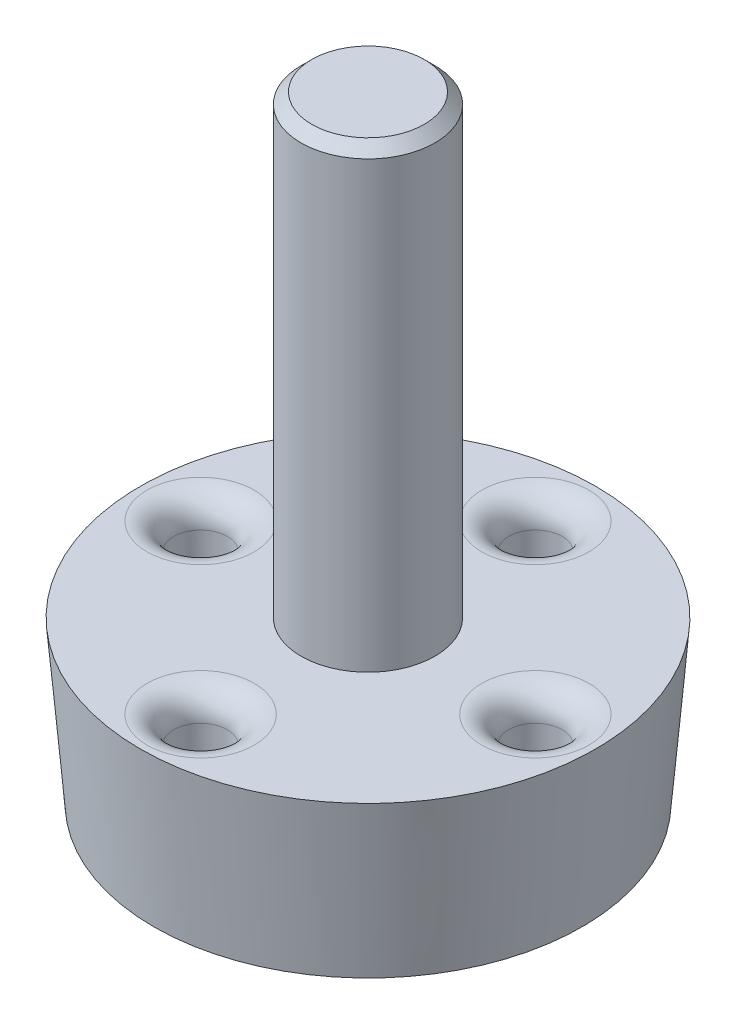
ISO-10303-21;
HEADER;
FILE_DESCRIPTION(('STEP AP214'),'2;1');
FILE_NAME('part.step','',(''),(''),'','','');
FILE_SCHEMA(('AUTOMOTIVE_DESIGN { 1 0 10303 214 1 1 1 1 }'));
ENDSEC;
DATA;
#1=APPLICATION_CONTEXT('core data for automotive mechanical design processes');
#2=APPLICATION_PROTOCOL_DEFINITION('international standard','automotive_design',2000,#1);
#3=PRODUCT_CONTEXT('',#1,'mechanical');
#4=PRODUCT('Part','Part','',(#3));
#5=PRODUCT_RELATED_PRODUCT_CATEGORY('part','',(#4));
#6=PRODUCT_DEFINITION_FORMATION('','',#4);
#7=PRODUCT_DEFINITION_CONTEXT('part definition',#1,'design');
#8=PRODUCT_DEFINITION('design','',#6,#7);
#9=PRODUCT_DEFINITION_SHAPE('','',#8);
#10=(LENGTH_UNIT() NAMED_UNIT(*) SI_UNIT(.MILLI.,.METRE.));
#11=(NAMED_UNIT(*) PLANE_ANGLE_UNIT() SI_UNIT($,.RADIAN.));
#12=(NAMED_UNIT(*) SI_UNIT($,.STERADIAN.) SOLID_ANGLE_UNIT());
#13=UNCERTAINTY_MEASURE_WITH_UNIT(LENGTH_MEASURE(1.E-05),#10,'distance_accuracy_value','');
#14=(GEOMETRIC_REPRESENTATION_CONTEXT(3) GLOBAL_UNCERTAINTY_ASSIGNED_CONTEXT((#13)) GLOBAL_UNIT_ASSIGNED_CONTEXT((#10,
#11,#12)) REPRESENTATION_CONTEXT('',''));
#15=CARTESIAN_POINT('',(0.,0.,0.));
#16=DIRECTION('',(0.,0.,1.));
#17=DIRECTION('',(1.,0.,0.));
#18=AXIS2_PLACEMENT_3D('',#15,#16,#17);
#19=CARTESIAN_POINT('',(0.,0.,0.));
#20=DIRECTION('',(0.,1.,0.));
#21=DIRECTION('',(0.,0.,1.));
#22=AXIS2_PLACEMENT_3D('',#19,#20,#21);
#23=PLANE('',#22);
#24=CARTESIAN_POINT('',(0.,0.,6.25));
#25=DIRECTION('',(0.,-1.,0.));
#26=DIRECTION('',(0.,0.,-1.));
#27=AXIS2_PLACEMENT_3D('',#24,#25,#26);
#28=CIRCLE('',#27,1.);
#29=CARTESIAN_POINT('',(0.,0.,5.25));
#30=VERTEX_POINT('',#29);
#31=EDGE_CURVE('E239',#30,#30,#28,.T.);
#32=ORIENTED_EDGE('',*,*,#31,.F.);
#33=EDGE_LOOP('',(#32));
#34=FACE_BOUND('',#33,.T.);
#35=CARTESIAN_POINT('',(6.25,0.,0.));
#36=DIRECTION('',(0.,-1.,0.));
#37=DIRECTION('',(0.,0.,-1.));
#38=AXIS2_PLACEMENT_3D('',#35,#36,#37);
#39=CIRCLE('',#38,1.);
#40=CARTESIAN_POINT('',(6.25,0.,-0.999999999999999));
#41=VERTEX_POINT('',#40);
#42=EDGE_CURVE('E244',#41,#41,#39,.T.);
#43=ORIENTED_EDGE('',*,*,#42,.F.);
#44=EDGE_LOOP('',(#43));
#45=FACE_BOUND('',#44,.T.);
#46=CARTESIAN_POINT('',(0.,0.,-6.25));
#47=DIRECTION('',(0.,-1.,0.));
#48=DIRECTION('',(0.,0.,-1.));
#49=AXIS2_PLACEMENT_3D('',#46,#47,#48);
#50=CIRCLE('',#49,1.);
#51=CARTESIAN_POINT('',(0.,0.,-7.25));
#52=VERTEX_POINT('',#51);
#53=EDGE_CURVE('E236',#52,#52,#50,.T.);
#54=ORIENTED_EDGE('',*,*,#53,.F.);
#55=EDGE_LOOP('',(#54));
#56=FACE_BOUND('',#55,.T.);
#57=CARTESIAN_POINT('',(-6.25,0.,0.));
#58=DIRECTION('',(0.,-1.,0.));
#59=DIRECTION('',(0.,0.,-1.));
#60=AXIS2_PLACEMENT_3D('',#57,#58,#59);
#61=CIRCLE('',#60,1.);
#62=CARTESIAN_POINT('',(-6.25,0.,-0.999999999999999));
#63=VERTEX_POINT('',#62);
#64=EDGE_CURVE('E232',#63,#63,#61,.T.);
#65=ORIENTED_EDGE('',*,*,#64,.F.);
#66=EDGE_LOOP('',(#65));
#67=FACE_BOUND('',#66,.T.);
#68=CARTESIAN_POINT('',(0.,0.,0.));
#69=DIRECTION('',(0.,-1.,0.));
#70=DIRECTION('',(0.,0.,-1.));
#71=AXIS2_PLACEMENT_3D('',#68,#69,#70);
#72=CIRCLE('',#71,4.5);
#73=CARTESIAN_POINT('',(0.,0.,-4.5));
#74=VERTEX_POINT('',#73);
#75=EDGE_CURVE('E243',#74,#74,#72,.T.);
#76=ORIENTED_EDGE('',*,*,#75,.F.);
#77=EDGE_LOOP('',(#76));
#78=FACE_BOUND('',#77,.T.);
#79=CARTESIAN_POINT('',(0.,0.,0.));
#80=DIRECTION('',(0.,1.,0.));
#81=DIRECTION('',(0.,0.,1.));
#82=AXIS2_PLACEMENT_3D('',#79,#80,#81);
#83=CIRCLE('',#82,8.);
#84=CARTESIAN_POINT('',(0.,0.,8.));
#85=VERTEX_POINT('',#84);
#86=EDGE_CURVE('E108',#85,#85,#83,.T.);
#87=ORIENTED_EDGE('',*,*,#86,.F.);
#88=EDGE_LOOP('',(#87));
#89=FACE_BOUND('',#88,.T.);
#90=ADVANCED_FACE('F53',(#34,#45,#56,#67,#78,#89),#23,.F.);
#91=CARTESIAN_POINT('',(0.,6.,0.));
#92=DIRECTION('',(0.,1.,0.));
#93=DIRECTION('',(0.,0.,1.));
#94=AXIS2_PLACEMENT_3D('',#91,#92,#93);
#95=PLANE('',#94);
#96=CARTESIAN_POINT('',(-6.25,6.,0.));
#97=DIRECTION('',(0.,1.,0.));
#98=DIRECTION('',(0.,0.,1.));
#99=AXIS2_PLACEMENT_3D('',#96,#97,#98);
#100=CIRCLE('',#99,2.);
#101=CARTESIAN_POINT('',(-6.25,6.,2.));
#102=VERTEX_POINT('',#101);
#103=EDGE_CURVE('E77',#102,#102,#100,.F.);
#104=ORIENTED_EDGE('',*,*,#103,.T.);
#105=EDGE_LOOP('',(#104));
#106=FACE_BOUND('',#105,.T.);
#107=CARTESIAN_POINT('',(0.,6.,6.25));
#108=DIRECTION('',(0.,1.,0.));
#109=DIRECTION('',(0.,0.,1.));
#110=AXIS2_PLACEMENT_3D('',#107,#108,#109);
#111=CIRCLE('',#110,2.);
#112=CARTESIAN_POINT('',(0.,6.,8.25));
#113=VERTEX_POINT('',#112);
#114=EDGE_CURVE('E81',#113,#113,#111,.F.);
#115=ORIENTED_EDGE('',*,*,#114,.T.);
#116=EDGE_LOOP('',(#115));
#117=FACE_BOUND('',#116,.T.);
#118=CARTESIAN_POINT('',(6.25,6.,0.));
#119=DIRECTION('',(0.,1.,0.));
#120=DIRECTION('',(0.,0.,1.));
#121=AXIS2_PLACEMENT_3D('',#118,#119,#120);
#122=CIRCLE('',#121,2.);
#123=CARTESIAN_POINT('',(6.25,6.,2.));
#124=VERTEX_POINT('',#123);
#125=EDGE_CURVE('E85',#124,#124,#122,.F.);
#126=ORIENTED_EDGE('',*,*,#125,.T.);
#127=EDGE_LOOP('',(#126));
#128=FACE_BOUND('',#127,.T.);
#129=CARTESIAN_POINT('',(0.,6.,-6.25));
#130=DIRECTION('',(0.,1.,0.));
#131=DIRECTION('',(0.,0.,1.));
#132=AXIS2_PLACEMENT_3D('',#129,#130,#131);
#133=CIRCLE('',#132,2.);
#134=CARTESIAN_POINT('',(0.,6.,-4.25));
#135=VERTEX_POINT('',#134);
#136=EDGE_CURVE('E89',#135,#135,#133,.F.);
#137=ORIENTED_EDGE('',*,*,#136,.T.);
#138=EDGE_LOOP('',(#137));
#139=FACE_BOUND('',#138,.T.);
#140=CARTESIAN_POINT('',(0.,6.,0.));
#141=DIRECTION('',(0.,1.,0.));
#142=DIRECTION('',(0.,0.,1.));
#143=AXIS2_PLACEMENT_3D('',#140,#141,#142);
#144=CIRCLE('',#143,2.5);
#145=CARTESIAN_POINT('',(0.,6.,2.5));
#146=VERTEX_POINT('',#145);
#147=EDGE_CURVE('E105',#146,#146,#144,.T.);
#148=ORIENTED_EDGE('',*,*,#147,.F.);
#149=EDGE_LOOP('',(#148));
#150=FACE_BOUND('',#149,.T.);
#151=CARTESIAN_POINT('',(0.,6.,0.));
#152=DIRECTION('',(0.,1.,0.));
#153=DIRECTION('',(0.,0.,1.));
#154=AXIS2_PLACEMENT_3D('',#151,#152,#153);
#155=CIRCLE('',#154,8.5);
#156=CARTESIAN_POINT('',(0.,6.,8.5));
#157=VERTEX_POINT('',#156);
#158=EDGE_CURVE('E112',#157,#157,#155,.T.);
#159=ORIENTED_EDGE('',*,*,#158,.T.);
#160=EDGE_LOOP('',(#159));
#161=FACE_BOUND('',#160,.T.);
#162=ADVANCED_FACE('F128',(#106,#117,#128,#139,#150,#161),#95,.T.);
#163=CARTESIAN_POINT('',(0.,0.,0.));
#164=DIRECTION('',(0.,1.,0.));
#165=DIRECTION('',(0.,0.,1.));
#166=AXIS2_PLACEMENT_3D('',#163,#164,#165);
#167=CONICAL_SURFACE('',#166,8.,0.0831412318884413);
#168=ORIENTED_EDGE('',*,*,#158,.F.);
#169=EDGE_LOOP('',(#168));
#170=FACE_BOUND('',#169,.T.);
#171=ORIENTED_EDGE('',*,*,#86,.T.);
#172=EDGE_LOOP('',(#171));
#173=FACE_BOUND('',#172,.T.);
#174=ADVANCED_FACE('F130',(#170,#173),#167,.T.);
#175=CARTESIAN_POINT('',(0.,23.,0.));
#176=DIRECTION('',(0.,-1.,0.));
#177=DIRECTION('',(0.,0.,-1.));
#178=AXIS2_PLACEMENT_3D('',#175,#176,#177);
#179=CYLINDRICAL_SURFACE('',#178,2.5);
#180=CARTESIAN_POINT('',(0.,22.6,0.));
#181=DIRECTION('',(0.,1.,0.));
#182=DIRECTION('',(0.,0.,1.));
#183=AXIS2_PLACEMENT_3D('',#180,#181,#182);
#184=CIRCLE('',#183,2.5);
#185=CARTESIAN_POINT('',(0.,22.6,2.5));
#186=VERTEX_POINT('',#185);
#187=EDGE_CURVE('E93',#186,#186,#184,.F.);
#188=ORIENTED_EDGE('',*,*,#187,.T.);
#189=EDGE_LOOP('',(#188));
#190=FACE_BOUND('',#189,.T.);
#191=ORIENTED_EDGE('',*,*,#147,.T.);
#192=EDGE_LOOP('',(#191));
#193=FACE_BOUND('',#192,.T.);
#194=ADVANCED_FACE('F192',(#190,#193),#179,.T.);
#195=CARTESIAN_POINT('',(0.,23.,0.));
#196=DIRECTION('',(0.,1.,0.));
#197=DIRECTION('',(0.,0.,1.));
#198=AXIS2_PLACEMENT_3D('',#195,#196,#197);
#199=PLANE('',#198);
#200=CARTESIAN_POINT('',(0.,23.,0.));
#201=DIRECTION('',(0.,1.,0.));
#202=DIRECTION('',(0.,0.,1.));
#203=AXIS2_PLACEMENT_3D('',#200,#201,#202);
#204=CIRCLE('',#203,2.1);
#205=CARTESIAN_POINT('',(0.,23.,2.1));
#206=VERTEX_POINT('',#205);
#207=EDGE_CURVE('E97',#206,#206,#204,.T.);
#208=ORIENTED_EDGE('',*,*,#207,.T.);
#209=EDGE_LOOP('',(#208));
#210=FACE_BOUND('',#209,.T.);
#211=ADVANCED_FACE('F195',(#210),#199,.T.);
#212=CARTESIAN_POINT('',(0.,2.,0.));
#213=DIRECTION('',(0.,-1.,0.));
#214=DIRECTION('',(0.,0.,-1.));
#215=AXIS2_PLACEMENT_3D('',#212,#213,#214);
#216=CYLINDRICAL_SURFACE('',#215,4.5);
#217=CARTESIAN_POINT('',(0.,2.,0.));
#218=DIRECTION('',(0.,-1.,0.));
#219=DIRECTION('',(0.,0.,-1.));
#220=AXIS2_PLACEMENT_3D('',#217,#218,#219);
#221=CIRCLE('',#220,4.5);
#222=CARTESIAN_POINT('',(0.,2.,-4.5));
#223=VERTEX_POINT('',#222);
#224=EDGE_CURVE('E176',#223,#223,#221,.T.);
#225=ORIENTED_EDGE('',*,*,#224,.F.);
#226=EDGE_LOOP('',(#225));
#227=FACE_BOUND('',#226,.T.);
#228=ORIENTED_EDGE('',*,*,#75,.T.);
#229=EDGE_LOOP('',(#228));
#230=FACE_BOUND('',#229,.T.);
#231=ADVANCED_FACE('F199',(#227,#230),#216,.F.);
#232=CARTESIAN_POINT('',(0.,2.,0.));
#233=DIRECTION('',(0.,-1.,0.));
#234=DIRECTION('',(0.,0.,-1.));
#235=AXIS2_PLACEMENT_3D('',#232,#233,#234);
#236=PLANE('',#235);
#237=CARTESIAN_POINT('',(0.,2.,0.));
#238=DIRECTION('',(0.,-1.,0.));
#239=DIRECTION('',(0.,0.,-1.));
#240=AXIS2_PLACEMENT_3D('',#237,#238,#239);
#241=CIRCLE('',#240,3.);
#242=CARTESIAN_POINT('',(0.,2.,-3.));
#243=VERTEX_POINT('',#242);
#244=EDGE_CURVE('E101',#243,#243,#241,.F.);
#245=ORIENTED_EDGE('',*,*,#244,.T.);
#246=EDGE_LOOP('',(#245));
#247=FACE_BOUND('',#246,.T.);
#248=ORIENTED_EDGE('',*,*,#224,.T.);
#249=EDGE_LOOP('',(#248));
#250=FACE_BOUND('',#249,.T.);
#251=ADVANCED_FACE('F203',(#247,#250),#236,.T.);
#252=CARTESIAN_POINT('',(-6.25,8.82842712474619,0.));
#253=DIRECTION('',(0.,-1.,0.));
#254=DIRECTION('',(0.,0.,-1.));
#255=AXIS2_PLACEMENT_3D('',#252,#253,#254);
#256=CYLINDRICAL_SURFACE('',#255,1.);
#257=CARTESIAN_POINT('',(-6.25,5.,0.));
#258=DIRECTION('',(0.,1.,0.));
#259=DIRECTION('',(0.,0.,1.));
#260=AXIS2_PLACEMENT_3D('',#257,#258,#259);
#261=CIRCLE('',#260,1.);
#262=CARTESIAN_POINT('',(-6.25,5.,1.));
#263=VERTEX_POINT('',#262);
#264=EDGE_CURVE('E71',#263,#263,#261,.T.);
#265=ORIENTED_EDGE('',*,*,#264,.T.);
#266=EDGE_LOOP('',(#265));
#267=FACE_BOUND('',#266,.T.);
#268=ORIENTED_EDGE('',*,*,#64,.T.);
#269=EDGE_LOOP('',(#268));
#270=FACE_BOUND('',#269,.T.);
#271=ADVANCED_FACE('F207',(#267,#270),#256,.F.);
#272=CARTESIAN_POINT('',(0.,8.82842712474619,-6.25));
#273=DIRECTION('',(0.,-1.,0.));
#274=DIRECTION('',(0.,0.,-1.));
#275=AXIS2_PLACEMENT_3D('',#272,#273,#274);
#276=CYLINDRICAL_SURFACE('',#275,1.);
#277=CARTESIAN_POINT('',(0.,5.,-6.25));
#278=DIRECTION('',(0.,1.,0.));
#279=DIRECTION('',(0.,0.,1.));
#280=AXIS2_PLACEMENT_3D('',#277,#278,#279);
#281=CIRCLE('',#280,1.);
#282=CARTESIAN_POINT('',(0.,5.,-5.25));
#283=VERTEX_POINT('',#282);
#284=EDGE_CURVE('E11',#283,#283,#281,.T.);
#285=ORIENTED_EDGE('',*,*,#284,.T.);
#286=EDGE_LOOP('',(#285));
#287=FACE_BOUND('',#286,.T.);
#288=ORIENTED_EDGE('',*,*,#53,.T.);
#289=EDGE_LOOP('',(#288));
#290=FACE_BOUND('',#289,.T.);
#291=ADVANCED_FACE('F211',(#287,#290),#276,.F.);
#292=CARTESIAN_POINT('',(6.25,8.82842712474619,0.));
#293=DIRECTION('',(0.,-1.,0.));
#294=DIRECTION('',(0.,0.,-1.));
#295=AXIS2_PLACEMENT_3D('',#292,#293,#294);
#296=CYLINDRICAL_SURFACE('',#295,1.);
#297=CARTESIAN_POINT('',(6.25,5.,0.));
#298=DIRECTION('',(0.,1.,0.));
#299=DIRECTION('',(0.,0.,1.));
#300=AXIS2_PLACEMENT_3D('',#297,#298,#299);
#301=CIRCLE('',#300,1.);
#302=CARTESIAN_POINT('',(6.25,5.,1.));
#303=VERTEX_POINT('',#302);
#304=EDGE_CURVE('E61',#303,#303,#301,.T.);
#305=ORIENTED_EDGE('',*,*,#304,.T.);
#306=EDGE_LOOP('',(#305));
#307=FACE_BOUND('',#306,.T.);
#308=ORIENTED_EDGE('',*,*,#42,.T.);
#309=EDGE_LOOP('',(#308));
#310=FACE_BOUND('',#309,.T.);
#311=ADVANCED_FACE('F215',(#307,#310),#296,.F.);
#312=CARTESIAN_POINT('',(0.,8.82842712474619,6.25));
#313=DIRECTION('',(0.,-1.,0.));
#314=DIRECTION('',(0.,0.,-1.));
#315=AXIS2_PLACEMENT_3D('',#312,#313,#314);
#316=CYLINDRICAL_SURFACE('',#315,1.);
#317=CARTESIAN_POINT('',(0.,5.,6.25));
#318=DIRECTION('',(0.,1.,0.));
#319=DIRECTION('',(0.,0.,1.));
#320=AXIS2_PLACEMENT_3D('',#317,#318,#319);
#321=CIRCLE('',#320,1.);
#322=CARTESIAN_POINT('',(0.,5.,7.25));
#323=VERTEX_POINT('',#322);
#324=EDGE_CURVE('E66',#323,#323,#321,.T.);
#325=ORIENTED_EDGE('',*,*,#324,.T.);
#326=EDGE_LOOP('',(#325));
#327=FACE_BOUND('',#326,.T.);
#328=ORIENTED_EDGE('',*,*,#31,.T.);
#329=EDGE_LOOP('',(#328));
#330=FACE_BOUND('',#329,.T.);
#331=ADVANCED_FACE('F218',(#327,#330),#316,.F.);
#332=CARTESIAN_POINT('',(0.,3.,0.));
#333=DIRECTION('',(0.,-1.,0.));
#334=DIRECTION('',(0.,0.,-1.));
#335=AXIS2_PLACEMENT_3D('',#332,#333,#334);
#336=PLANE('',#335);
#337=CARTESIAN_POINT('',(0.,3.,0.));
#338=DIRECTION('',(0.,-1.,0.));
#339=DIRECTION('',(0.,0.,-1.));
#340=AXIS2_PLACEMENT_3D('',#337,#338,#339);
#341=CIRCLE('',#340,2.);
#342=CARTESIAN_POINT('',(0.,3.,-2.));
#343=VERTEX_POINT('',#342);
#344=EDGE_CURVE('E229',#343,#343,#341,.T.);
#345=ORIENTED_EDGE('',*,*,#344,.T.);
#346=EDGE_LOOP('',(#345));
#347=FACE_BOUND('',#346,.T.);
#348=ADVANCED_FACE('F137',(#347),#336,.T.);
#349=CARTESIAN_POINT('',(0.,3.,0.));
#350=DIRECTION('',(0.,-1.,0.));
#351=DIRECTION('',(0.,0.,-1.));
#352=AXIS2_PLACEMENT_3D('',#349,#350,#351);
#353=TOROIDAL_SURFACE('',#352,3.,1.);
#354=ORIENTED_EDGE('',*,*,#244,.F.);
#355=EDGE_LOOP('',(#354));
#356=FACE_BOUND('',#355,.T.);
#357=ORIENTED_EDGE('',*,*,#344,.F.);
#358=EDGE_LOOP('',(#357));
#359=FACE_BOUND('',#358,.T.);
#360=ADVANCED_FACE('F133',(#356,#359),#353,.T.);
#361=CARTESIAN_POINT('',(0.,23.,0.));
#362=DIRECTION('',(0.,-1.,0.));
#363=DIRECTION('',(0.,0.,-1.));
#364=AXIS2_PLACEMENT_3D('',#361,#362,#363);
#365=CONICAL_SURFACE('',#364,2.1,0.785398163397441);
#366=ORIENTED_EDGE('',*,*,#187,.F.);
#367=EDGE_LOOP('',(#366));
#368=FACE_BOUND('',#367,.T.);
#369=ORIENTED_EDGE('',*,*,#207,.F.);
#370=EDGE_LOOP('',(#369));
#371=FACE_BOUND('',#370,.T.);
#372=ADVANCED_FACE('F136',(#368,#371),#365,.T.);
#373=CARTESIAN_POINT('',(-6.25,5.,0.));
#374=DIRECTION('',(0.,1.,0.));
#375=DIRECTION('',(0.,0.,1.));
#376=AXIS2_PLACEMENT_3D('',#373,#374,#375);
#377=TOROIDAL_SURFACE('',#376,2.,1.);
#378=ORIENTED_EDGE('',*,*,#264,.F.);
#379=EDGE_LOOP('',(#378));
#380=FACE_BOUND('',#379,.T.);
#381=ORIENTED_EDGE('',*,*,#103,.F.);
#382=EDGE_LOOP('',(#381));
#383=FACE_BOUND('',#382,.T.);
#384=ADVANCED_FACE('F144',(#380,#383),#377,.T.);
#385=CARTESIAN_POINT('',(0.,5.,6.25));
#386=DIRECTION('',(0.,1.,0.));
#387=DIRECTION('',(0.,0.,1.));
#388=AXIS2_PLACEMENT_3D('',#385,#386,#387);
#389=TOROIDAL_SURFACE('',#388,2.,1.);
#390=ORIENTED_EDGE('',*,*,#324,.F.);
#391=EDGE_LOOP('',(#390));
#392=FACE_BOUND('',#391,.T.);
#393=ORIENTED_EDGE('',*,*,#114,.F.);
#394=EDGE_LOOP('',(#393));
#395=FACE_BOUND('',#394,.T.);
#396=ADVANCED_FACE('F148',(#392,#395),#389,.T.);
#397=CARTESIAN_POINT('',(6.25,5.,0.));
#398=DIRECTION('',(0.,1.,0.));
#399=DIRECTION('',(0.,0.,1.));
#400=AXIS2_PLACEMENT_3D('',#397,#398,#399);
#401=TOROIDAL_SURFACE('',#400,2.,1.);
#402=ORIENTED_EDGE('',*,*,#304,.F.);
#403=EDGE_LOOP('',(#402));
#404=FACE_BOUND('',#403,.T.);
#405=ORIENTED_EDGE('',*,*,#125,.F.);
#406=EDGE_LOOP('',(#405));
#407=FACE_BOUND('',#406,.T.);
#408=ADVANCED_FACE('F151',(#404,#407),#401,.T.);
#409=CARTESIAN_POINT('',(0.,5.,-6.25));
#410=DIRECTION('',(0.,1.,0.));
#411=DIRECTION('',(0.,0.,1.));
#412=AXIS2_PLACEMENT_3D('',#409,#410,#411);
#413=TOROIDAL_SURFACE('',#412,2.,1.);
#414=ORIENTED_EDGE('',*,*,#284,.F.);
#415=EDGE_LOOP('',(#414));
#416=FACE_BOUND('',#415,.T.);
#417=ORIENTED_EDGE('',*,*,#136,.F.);
#418=EDGE_LOOP('',(#417));
#419=FACE_BOUND('',#418,.T.);
#420=ADVANCED_FACE('F55',(#416,#419),#413,.T.);
#421=CLOSED_SHELL('',(#90,#162,#174,#194,#211,#231,#251,#271,#291,#311,#331,#348,#360,#372,#384,
#396,#408,#420));
#422=MANIFOLD_SOLID_BREP('B2',#421);
#423=ADVANCED_BREP_SHAPE_REPRESENTATION('',(#18,#422),#14);
#424=SHAPE_DEFINITION_REPRESENTATION(#9,#423);
ENDSEC;
END-ISO-10303-21;
